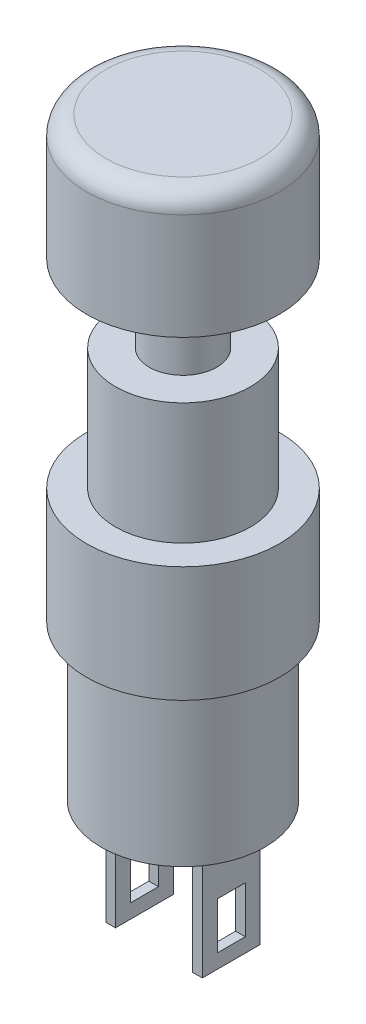
ISO-10303-21;
HEADER;
FILE_DESCRIPTION(('STEP AP214'),'2;1');
FILE_NAME('part.step','',(''),(''),'','','');
FILE_SCHEMA(('AUTOMOTIVE_DESIGN { 1 0 10303 214 1 1 1 1 }'));
ENDSEC;
DATA;
#1=APPLICATION_CONTEXT('core data for automotive mechanical design processes');
#2=APPLICATION_PROTOCOL_DEFINITION('international standard','automotive_design',2000,#1);
#3=PRODUCT_CONTEXT('',#1,'mechanical');
#4=PRODUCT('Part','Part','',(#3));
#5=PRODUCT_RELATED_PRODUCT_CATEGORY('part','',(#4));
#6=PRODUCT_DEFINITION_FORMATION('','',#4);
#7=PRODUCT_DEFINITION_CONTEXT('part definition',#1,'design');
#8=PRODUCT_DEFINITION('design','',#6,#7);
#9=PRODUCT_DEFINITION_SHAPE('','',#8);
#10=(LENGTH_UNIT() NAMED_UNIT(*) SI_UNIT(.MILLI.,.METRE.));
#11=(NAMED_UNIT(*) PLANE_ANGLE_UNIT() SI_UNIT($,.RADIAN.));
#12=(NAMED_UNIT(*) SI_UNIT($,.STERADIAN.) SOLID_ANGLE_UNIT());
#13=UNCERTAINTY_MEASURE_WITH_UNIT(LENGTH_MEASURE(1.E-05),#10,'distance_accuracy_value','');
#14=(GEOMETRIC_REPRESENTATION_CONTEXT(3) GLOBAL_UNCERTAINTY_ASSIGNED_CONTEXT((#13)) GLOBAL_UNIT_ASSIGNED_CONTEXT((#10,
#11,#12)) REPRESENTATION_CONTEXT('',''));
#15=CARTESIAN_POINT('',(0.,0.,0.));
#16=DIRECTION('',(0.,0.,1.));
#17=DIRECTION('',(1.,0.,0.));
#18=AXIS2_PLACEMENT_3D('',#15,#16,#17);
#19=CARTESIAN_POINT('',(0.,12.3,0.));
#20=DIRECTION('',(0.,1.,0.));
#21=DIRECTION('',(0.,0.,1.));
#22=AXIS2_PLACEMENT_3D('',#19,#20,#21);
#23=PLANE('',#22);
#24=CARTESIAN_POINT('',(0.,12.3,0.));
#25=DIRECTION('',(0.,1.,0.));
#26=DIRECTION('',(0.,0.,1.));
#27=AXIS2_PLACEMENT_3D('',#24,#25,#26);
#28=CIRCLE('',#27,3.5);
#29=CARTESIAN_POINT('',(0.,12.3,3.5));
#30=VERTEX_POINT('',#29);
#31=EDGE_CURVE('E399',#30,#30,#28,.T.);
#32=ORIENTED_EDGE('',*,*,#31,.T.);
#33=EDGE_LOOP('',(#32));
#34=FACE_BOUND('',#33,.T.);
#35=CARTESIAN_POINT('',(0.,12.3,0.));
#36=DIRECTION('',(0.,1.,0.));
#37=DIRECTION('',(0.,0.,1.));
#38=AXIS2_PLACEMENT_3D('',#35,#36,#37);
#39=CIRCLE('',#38,1.75);
#40=CARTESIAN_POINT('',(0.,12.3,1.75));
#41=VERTEX_POINT('',#40);
#42=EDGE_CURVE('E404',#41,#41,#39,.T.);
#43=ORIENTED_EDGE('',*,*,#42,.F.);
#44=EDGE_LOOP('',(#43));
#45=FACE_BOUND('',#44,.T.);
#46=ADVANCED_FACE('F34',(#34,#45),#23,.T.);
#47=CARTESIAN_POINT('',(0.,6.,0.));
#48=DIRECTION('',(0.,1.,0.));
#49=DIRECTION('',(0.,0.,1.));
#50=AXIS2_PLACEMENT_3D('',#47,#48,#49);
#51=PLANE('',#50);
#52=CARTESIAN_POINT('',(0.,6.,0.));
#53=DIRECTION('',(0.,1.,0.));
#54=DIRECTION('',(0.,0.,1.));
#55=AXIS2_PLACEMENT_3D('',#52,#53,#54);
#56=CIRCLE('',#55,5.);
#57=CARTESIAN_POINT('',(0.,6.,5.));
#58=VERTEX_POINT('',#57);
#59=EDGE_CURVE('E278',#58,#58,#56,.T.);
#60=ORIENTED_EDGE('',*,*,#59,.T.);
#61=EDGE_LOOP('',(#60));
#62=FACE_BOUND('',#61,.T.);
#63=CARTESIAN_POINT('',(0.,6.,0.));
#64=DIRECTION('',(0.,1.,0.));
#65=DIRECTION('',(0.,0.,1.));
#66=AXIS2_PLACEMENT_3D('',#63,#64,#65);
#67=CIRCLE('',#66,3.5);
#68=CARTESIAN_POINT('',(0.,6.,3.5));
#69=VERTEX_POINT('',#68);
#70=EDGE_CURVE('E397',#69,#69,#67,.T.);
#71=ORIENTED_EDGE('',*,*,#70,.F.);
#72=EDGE_LOOP('',(#71));
#73=FACE_BOUND('',#72,.T.);
#74=ADVANCED_FACE('F299',(#62,#73),#51,.T.);
#75=CARTESIAN_POINT('',(0.,-8.,0.));
#76=DIRECTION('',(0.,-1.,0.));
#77=DIRECTION('',(0.,0.,-1.));
#78=AXIS2_PLACEMENT_3D('',#75,#76,#77);
#79=PLANE('',#78);
#80=DIRECTION('',(-1.,0.,0.));
#81=VECTOR('',#80,1.);
#82=CARTESIAN_POINT('',(2.,-8.,1.5));
#83=LINE('',#82,#81);
#84=CARTESIAN_POINT('',(2.5,-8.,1.5));
#85=VERTEX_POINT('',#84);
#86=CARTESIAN_POINT('',(2.,-8.,1.5));
#87=VERTEX_POINT('',#86);
#88=EDGE_CURVE('E259',#85,#87,#83,.T.);
#89=ORIENTED_EDGE('',*,*,#88,.F.);
#90=DIRECTION('',(0.,0.,1.));
#91=VECTOR('',#90,1.);
#92=CARTESIAN_POINT('',(2.5,-8.,-1.5));
#93=LINE('',#92,#91);
#94=CARTESIAN_POINT('',(2.5,-8.,-1.5));
#95=VERTEX_POINT('',#94);
#96=EDGE_CURVE('E245',#95,#85,#93,.T.);
#97=ORIENTED_EDGE('',*,*,#96,.F.);
#98=DIRECTION('',(1.,0.,0.));
#99=VECTOR('',#98,1.);
#100=CARTESIAN_POINT('',(2.,-8.,-1.5));
#101=LINE('',#100,#99);
#102=CARTESIAN_POINT('',(2.,-8.,-1.5));
#103=VERTEX_POINT('',#102);
#104=EDGE_CURVE('E250',#103,#95,#101,.T.);
#105=ORIENTED_EDGE('',*,*,#104,.F.);
#106=DIRECTION('',(0.,0.,-1.));
#107=VECTOR('',#106,1.);
#108=CARTESIAN_POINT('',(2.,-8.,-1.5));
#109=LINE('',#108,#107);
#110=EDGE_CURVE('E261',#87,#103,#109,.T.);
#111=ORIENTED_EDGE('',*,*,#110,.F.);
#112=EDGE_LOOP('',(#89,#97,#105,#111));
#113=FACE_BOUND('',#112,.T.);
#114=CARTESIAN_POINT('',(0.,-8.,0.));
#115=DIRECTION('',(0.,-1.,0.));
#116=DIRECTION('',(0.,0.,-1.));
#117=AXIS2_PLACEMENT_3D('',#114,#115,#116);
#118=CIRCLE('',#117,4.25);
#119=CARTESIAN_POINT('',(0.,-8.,-4.25));
#120=VERTEX_POINT('',#119);
#121=EDGE_CURVE('E274',#120,#120,#118,.T.);
#122=ORIENTED_EDGE('',*,*,#121,.T.);
#123=EDGE_LOOP('',(#122));
#124=FACE_BOUND('',#123,.T.);
#125=DIRECTION('',(-1.,0.,0.));
#126=VECTOR('',#125,1.);
#127=CARTESIAN_POINT('',(-2.,-8.,1.5));
#128=LINE('',#127,#126);
#129=CARTESIAN_POINT('',(-2.,-8.,1.5));
#130=VERTEX_POINT('',#129);
#131=CARTESIAN_POINT('',(-2.5,-8.,1.5));
#132=VERTEX_POINT('',#131);
#133=EDGE_CURVE('E230',#130,#132,#128,.T.);
#134=ORIENTED_EDGE('',*,*,#133,.F.);
#135=DIRECTION('',(0.,0.,1.));
#136=VECTOR('',#135,1.);
#137=CARTESIAN_POINT('',(-2.,-8.,-1.5));
#138=LINE('',#137,#136);
#139=CARTESIAN_POINT('',(-2.,-8.,-1.5));
#140=VERTEX_POINT('',#139);
#141=EDGE_CURVE('E216',#140,#130,#138,.T.);
#142=ORIENTED_EDGE('',*,*,#141,.F.);
#143=DIRECTION('',(1.,0.,0.));
#144=VECTOR('',#143,1.);
#145=CARTESIAN_POINT('',(-2.,-8.,-1.5));
#146=LINE('',#145,#144);
#147=CARTESIAN_POINT('',(-2.5,-8.,-1.5));
#148=VERTEX_POINT('',#147);
#149=EDGE_CURVE('E221',#148,#140,#146,.T.);
#150=ORIENTED_EDGE('',*,*,#149,.F.);
#151=DIRECTION('',(0.,0.,-1.));
#152=VECTOR('',#151,1.);
#153=CARTESIAN_POINT('',(-2.5,-8.,-1.5));
#154=LINE('',#153,#152);
#155=EDGE_CURVE('E232',#132,#148,#154,.T.);
#156=ORIENTED_EDGE('',*,*,#155,.F.);
#157=EDGE_LOOP('',(#134,#142,#150,#156));
#158=FACE_BOUND('',#157,.T.);
#159=ADVANCED_FACE('F305',(#113,#124,#158),#79,.T.);
#160=CARTESIAN_POINT('',(0.,0.,0.));
#161=DIRECTION('',(0.,1.,0.));
#162=DIRECTION('',(0.,0.,1.));
#163=AXIS2_PLACEMENT_3D('',#160,#161,#162);
#164=PLANE('',#163);
#165=CARTESIAN_POINT('',(0.,0.,0.));
#166=DIRECTION('',(0.,1.,0.));
#167=DIRECTION('',(0.,0.,1.));
#168=AXIS2_PLACEMENT_3D('',#165,#166,#167);
#169=CIRCLE('',#168,5.);
#170=CARTESIAN_POINT('',(0.,0.,5.));
#171=VERTEX_POINT('',#170);
#172=EDGE_CURVE('E277',#171,#171,#169,.T.);
#173=ORIENTED_EDGE('',*,*,#172,.F.);
#174=EDGE_LOOP('',(#173));
#175=FACE_BOUND('',#174,.T.);
#176=CARTESIAN_POINT('',(0.,0.,0.));
#177=DIRECTION('',(0.,1.,0.));
#178=DIRECTION('',(0.,0.,1.));
#179=AXIS2_PLACEMENT_3D('',#176,#177,#178);
#180=CIRCLE('',#179,4.25);
#181=CARTESIAN_POINT('',(0.,0.,4.25));
#182=VERTEX_POINT('',#181);
#183=EDGE_CURVE('E281',#182,#182,#180,.F.);
#184=ORIENTED_EDGE('',*,*,#183,.F.);
#185=EDGE_LOOP('',(#184));
#186=FACE_BOUND('',#185,.T.);
#187=ADVANCED_FACE('F376',(#175,#186),#164,.F.);
#188=CARTESIAN_POINT('',(0.,6.,0.));
#189=DIRECTION('',(0.,-1.,0.));
#190=DIRECTION('',(0.,0.,-1.));
#191=AXIS2_PLACEMENT_3D('',#188,#189,#190);
#192=CYLINDRICAL_SURFACE('',#191,5.);
#193=ORIENTED_EDGE('',*,*,#59,.F.);
#194=EDGE_LOOP('',(#193));
#195=FACE_BOUND('',#194,.T.);
#196=ORIENTED_EDGE('',*,*,#172,.T.);
#197=EDGE_LOOP('',(#196));
#198=FACE_BOUND('',#197,.T.);
#199=ADVANCED_FACE('F379',(#195,#198),#192,.T.);
#200=CARTESIAN_POINT('',(0.,-8.,0.));
#201=DIRECTION('',(0.,1.,0.));
#202=DIRECTION('',(0.,0.,1.));
#203=AXIS2_PLACEMENT_3D('',#200,#201,#202);
#204=CYLINDRICAL_SURFACE('',#203,4.25);
#205=ORIENTED_EDGE('',*,*,#121,.F.);
#206=EDGE_LOOP('',(#205));
#207=FACE_BOUND('',#206,.T.);
#208=ORIENTED_EDGE('',*,*,#183,.T.);
#209=EDGE_LOOP('',(#208));
#210=FACE_BOUND('',#209,.T.);
#211=ADVANCED_FACE('F372',(#207,#210),#204,.T.);
#212=CARTESIAN_POINT('',(2.5,-14.,-1.5));
#213=DIRECTION('',(-1.,0.,0.));
#214=DIRECTION('',(0.,0.,1.));
#215=AXIS2_PLACEMENT_3D('',#212,#213,#214);
#216=PLANE('',#215);
#217=DIRECTION('',(0.,0.,-1.));
#218=VECTOR('',#217,1.);
#219=CARTESIAN_POINT('',(2.5,-10.8387417934711,-1.5));
#220=LINE('',#219,#218);
#221=CARTESIAN_POINT('',(2.5,-10.8387417934711,0.71438599194853));
#222=VERTEX_POINT('',#221);
#223=CARTESIAN_POINT('',(2.5,-10.8387417934711,-0.728581274216814));
#224=VERTEX_POINT('',#223);
#225=EDGE_CURVE('E204',#222,#224,#220,.T.);
#226=ORIENTED_EDGE('',*,*,#225,.T.);
#227=DIRECTION('',(0.,-1.,0.));
#228=VECTOR('',#227,1.);
#229=CARTESIAN_POINT('',(2.5,-14.,-0.728581274216814));
#230=LINE('',#229,#228);
#231=CARTESIAN_POINT('',(2.5,-13.2621868174154,-0.728581274216814));
#232=VERTEX_POINT('',#231);
#233=EDGE_CURVE('E213',#224,#232,#230,.T.);
#234=ORIENTED_EDGE('',*,*,#233,.T.);
#235=DIRECTION('',(0.,0.,1.));
#236=VECTOR('',#235,1.);
#237=CARTESIAN_POINT('',(2.5,-13.2621868174154,-1.5));
#238=LINE('',#237,#236);
#239=CARTESIAN_POINT('',(2.5,-13.2621868174154,0.714385991948531));
#240=VERTEX_POINT('',#239);
#241=EDGE_CURVE('E188',#232,#240,#238,.T.);
#242=ORIENTED_EDGE('',*,*,#241,.T.);
#243=DIRECTION('',(0.,1.,0.));
#244=VECTOR('',#243,1.);
#245=CARTESIAN_POINT('',(2.5,-14.,0.71438599194853));
#246=LINE('',#245,#244);
#247=EDGE_CURVE('E195',#240,#222,#246,.T.);
#248=ORIENTED_EDGE('',*,*,#247,.T.);
#249=EDGE_LOOP('',(#226,#234,#242,#248));
#250=FACE_BOUND('',#249,.T.);
#251=ORIENTED_EDGE('',*,*,#96,.T.);
#252=DIRECTION('',(0.,1.,0.));
#253=VECTOR('',#252,1.);
#254=CARTESIAN_POINT('',(2.5,-14.,1.5));
#255=LINE('',#254,#253);
#256=CARTESIAN_POINT('',(2.5,-14.,1.5));
#257=VERTEX_POINT('',#256);
#258=EDGE_CURVE('E272',#257,#85,#255,.T.);
#259=ORIENTED_EDGE('',*,*,#258,.F.);
#260=DIRECTION('',(0.,0.,1.));
#261=VECTOR('',#260,1.);
#262=CARTESIAN_POINT('',(2.5,-14.,-1.5));
#263=LINE('',#262,#261);
#264=CARTESIAN_POINT('',(2.5,-14.,-1.5));
#265=VERTEX_POINT('',#264);
#266=EDGE_CURVE('E246',#265,#257,#263,.T.);
#267=ORIENTED_EDGE('',*,*,#266,.F.);
#268=DIRECTION('',(0.,1.,0.));
#269=VECTOR('',#268,1.);
#270=CARTESIAN_POINT('',(2.5,-14.,-1.5));
#271=LINE('',#270,#269);
#272=EDGE_CURVE('E256',#265,#95,#271,.T.);
#273=ORIENTED_EDGE('',*,*,#272,.T.);
#274=EDGE_LOOP('',(#251,#259,#267,#273));
#275=FACE_BOUND('',#274,.T.);
#276=ADVANCED_FACE('F368',(#250,#275),#216,.F.);
#277=CARTESIAN_POINT('',(2.,-14.,1.5));
#278=DIRECTION('',(0.,0.,-1.));
#279=DIRECTION('',(-1.,0.,0.));
#280=AXIS2_PLACEMENT_3D('',#277,#278,#279);
#281=PLANE('',#280);
#282=ORIENTED_EDGE('',*,*,#88,.T.);
#283=DIRECTION('',(0.,1.,0.));
#284=VECTOR('',#283,1.);
#285=CARTESIAN_POINT('',(2.,-14.,1.5));
#286=LINE('',#285,#284);
#287=CARTESIAN_POINT('',(2.,-14.,1.5));
#288=VERTEX_POINT('',#287);
#289=EDGE_CURVE('E269',#288,#87,#286,.T.);
#290=ORIENTED_EDGE('',*,*,#289,.F.);
#291=DIRECTION('',(-1.,0.,0.));
#292=VECTOR('',#291,1.);
#293=CARTESIAN_POINT('',(2.,-14.,1.5));
#294=LINE('',#293,#292);
#295=EDGE_CURVE('E249',#257,#288,#294,.T.);
#296=ORIENTED_EDGE('',*,*,#295,.F.);
#297=ORIENTED_EDGE('',*,*,#258,.T.);
#298=EDGE_LOOP('',(#282,#290,#296,#297));
#299=FACE_BOUND('',#298,.T.);
#300=ADVANCED_FACE('F364',(#299),#281,.F.);
#301=CARTESIAN_POINT('',(2.,-14.,-1.5));
#302=DIRECTION('',(1.,0.,0.));
#303=DIRECTION('',(0.,0.,-1.));
#304=AXIS2_PLACEMENT_3D('',#301,#302,#303);
#305=PLANE('',#304);
#306=DIRECTION('',(0.,0.,-1.));
#307=VECTOR('',#306,1.);
#308=CARTESIAN_POINT('',(2.,-13.2621868174154,-1.5));
#309=LINE('',#308,#307);
#310=CARTESIAN_POINT('',(2.,-13.2621868174154,0.71438599194853));
#311=VERTEX_POINT('',#310);
#312=CARTESIAN_POINT('',(2.,-13.2621868174154,-0.728581274216815));
#313=VERTEX_POINT('',#312);
#314=EDGE_CURVE('E185',#311,#313,#309,.T.);
#315=ORIENTED_EDGE('',*,*,#314,.T.);
#316=DIRECTION('',(0.,1.,0.));
#317=VECTOR('',#316,1.);
#318=CARTESIAN_POINT('',(2.,-14.,-0.728581274216814));
#319=LINE('',#318,#317);
#320=CARTESIAN_POINT('',(2.,-10.8387417934711,-0.728581274216814));
#321=VERTEX_POINT('',#320);
#322=EDGE_CURVE('E210',#313,#321,#319,.T.);
#323=ORIENTED_EDGE('',*,*,#322,.T.);
#324=DIRECTION('',(0.,0.,1.));
#325=VECTOR('',#324,1.);
#326=CARTESIAN_POINT('',(2.,-10.8387417934711,-1.5));
#327=LINE('',#326,#325);
#328=CARTESIAN_POINT('',(2.,-10.8387417934711,0.71438599194853));
#329=VERTEX_POINT('',#328);
#330=EDGE_CURVE('E201',#321,#329,#327,.T.);
#331=ORIENTED_EDGE('',*,*,#330,.T.);
#332=DIRECTION('',(0.,-1.,0.));
#333=VECTOR('',#332,1.);
#334=CARTESIAN_POINT('',(2.,-14.,0.71438599194853));
#335=LINE('',#334,#333);
#336=EDGE_CURVE('E192',#329,#311,#335,.T.);
#337=ORIENTED_EDGE('',*,*,#336,.T.);
#338=EDGE_LOOP('',(#315,#323,#331,#337));
#339=FACE_BOUND('',#338,.T.);
#340=ORIENTED_EDGE('',*,*,#110,.T.);
#341=DIRECTION('',(0.,1.,0.));
#342=VECTOR('',#341,1.);
#343=CARTESIAN_POINT('',(2.,-14.,-1.5));
#344=LINE('',#343,#342);
#345=CARTESIAN_POINT('',(2.,-14.,-1.5));
#346=VERTEX_POINT('',#345);
#347=EDGE_CURVE('E267',#346,#103,#344,.T.);
#348=ORIENTED_EDGE('',*,*,#347,.F.);
#349=DIRECTION('',(0.,0.,-1.));
#350=VECTOR('',#349,1.);
#351=CARTESIAN_POINT('',(2.,-14.,-1.5));
#352=LINE('',#351,#350);
#353=EDGE_CURVE('E252',#288,#346,#352,.T.);
#354=ORIENTED_EDGE('',*,*,#353,.F.);
#355=ORIENTED_EDGE('',*,*,#289,.T.);
#356=EDGE_LOOP('',(#340,#348,#354,#355));
#357=FACE_BOUND('',#356,.T.);
#358=ADVANCED_FACE('F360',(#339,#357),#305,.F.);
#359=CARTESIAN_POINT('',(2.,-14.,-1.5));
#360=DIRECTION('',(0.,0.,1.));
#361=DIRECTION('',(1.,0.,0.));
#362=AXIS2_PLACEMENT_3D('',#359,#360,#361);
#363=PLANE('',#362);
#364=ORIENTED_EDGE('',*,*,#104,.T.);
#365=ORIENTED_EDGE('',*,*,#272,.F.);
#366=DIRECTION('',(1.,0.,0.));
#367=VECTOR('',#366,1.);
#368=CARTESIAN_POINT('',(2.,-14.,-1.5));
#369=LINE('',#368,#367);
#370=EDGE_CURVE('E254',#346,#265,#369,.T.);
#371=ORIENTED_EDGE('',*,*,#370,.F.);
#372=ORIENTED_EDGE('',*,*,#347,.T.);
#373=EDGE_LOOP('',(#364,#365,#371,#372));
#374=FACE_BOUND('',#373,.T.);
#375=ADVANCED_FACE('F356',(#374),#363,.F.);
#376=CARTESIAN_POINT('',(2.5,-14.,1.5));
#377=DIRECTION('',(0.,1.,0.));
#378=DIRECTION('',(0.,0.,1.));
#379=AXIS2_PLACEMENT_3D('',#376,#377,#378);
#380=PLANE('',#379);
#381=ORIENTED_EDGE('',*,*,#266,.T.);
#382=ORIENTED_EDGE('',*,*,#295,.T.);
#383=ORIENTED_EDGE('',*,*,#353,.T.);
#384=ORIENTED_EDGE('',*,*,#370,.T.);
#385=EDGE_LOOP('',(#381,#382,#383,#384));
#386=FACE_BOUND('',#385,.T.);
#387=ADVANCED_FACE('F352',(#386),#380,.F.);
#388=CARTESIAN_POINT('',(-2.,-14.,-1.5));
#389=DIRECTION('',(-1.,0.,0.));
#390=DIRECTION('',(0.,0.,1.));
#391=AXIS2_PLACEMENT_3D('',#388,#389,#390);
#392=PLANE('',#391);
#393=DIRECTION('',(0.,0.,-1.));
#394=VECTOR('',#393,1.);
#395=CARTESIAN_POINT('',(-2.,-10.8387417934711,-1.5));
#396=LINE('',#395,#394);
#397=CARTESIAN_POINT('',(-2.,-10.8387417934711,0.714385991948529));
#398=VERTEX_POINT('',#397);
#399=CARTESIAN_POINT('',(-2.,-10.8387417934711,-0.728581274216815));
#400=VERTEX_POINT('',#399);
#401=EDGE_CURVE('E198',#398,#400,#396,.T.);
#402=ORIENTED_EDGE('',*,*,#401,.T.);
#403=DIRECTION('',(0.,-1.,0.));
#404=VECTOR('',#403,1.);
#405=CARTESIAN_POINT('',(-2.,-14.,-0.728581274216815));
#406=LINE('',#405,#404);
#407=CARTESIAN_POINT('',(-2.,-13.2621868174154,-0.728581274216815));
#408=VERTEX_POINT('',#407);
#409=EDGE_CURVE('E207',#400,#408,#406,.T.);
#410=ORIENTED_EDGE('',*,*,#409,.T.);
#411=DIRECTION('',(0.,0.,1.));
#412=VECTOR('',#411,1.);
#413=CARTESIAN_POINT('',(-2.,-13.2621868174154,-1.5));
#414=LINE('',#413,#412);
#415=CARTESIAN_POINT('',(-2.,-13.2621868174154,0.714385991948531));
#416=VERTEX_POINT('',#415);
#417=EDGE_CURVE('E183',#408,#416,#414,.T.);
#418=ORIENTED_EDGE('',*,*,#417,.T.);
#419=DIRECTION('',(0.,1.,0.));
#420=VECTOR('',#419,1.);
#421=CARTESIAN_POINT('',(-2.,-14.,0.714385991948529));
#422=LINE('',#421,#420);
#423=EDGE_CURVE('E154',#416,#398,#422,.T.);
#424=ORIENTED_EDGE('',*,*,#423,.T.);
#425=EDGE_LOOP('',(#402,#410,#418,#424));
#426=FACE_BOUND('',#425,.T.);
#427=ORIENTED_EDGE('',*,*,#141,.T.);
#428=DIRECTION('',(0.,1.,0.));
#429=VECTOR('',#428,1.);
#430=CARTESIAN_POINT('',(-2.,-14.,1.5));
#431=LINE('',#430,#429);
#432=CARTESIAN_POINT('',(-2.,-14.,1.5));
#433=VERTEX_POINT('',#432);
#434=EDGE_CURVE('E243',#433,#130,#431,.T.);
#435=ORIENTED_EDGE('',*,*,#434,.F.);
#436=DIRECTION('',(0.,0.,1.));
#437=VECTOR('',#436,1.);
#438=CARTESIAN_POINT('',(-2.,-14.,-1.5));
#439=LINE('',#438,#437);
#440=CARTESIAN_POINT('',(-2.,-14.,-1.5));
#441=VERTEX_POINT('',#440);
#442=EDGE_CURVE('E217',#441,#433,#439,.T.);
#443=ORIENTED_EDGE('',*,*,#442,.F.);
#444=DIRECTION('',(0.,1.,0.));
#445=VECTOR('',#444,1.);
#446=CARTESIAN_POINT('',(-2.,-14.,-1.5));
#447=LINE('',#446,#445);
#448=EDGE_CURVE('E227',#441,#140,#447,.T.);
#449=ORIENTED_EDGE('',*,*,#448,.T.);
#450=EDGE_LOOP('',(#427,#435,#443,#449));
#451=FACE_BOUND('',#450,.T.);
#452=ADVANCED_FACE('F348',(#426,#451),#392,.F.);
#453=CARTESIAN_POINT('',(-2.,-14.,1.5));
#454=DIRECTION('',(0.,0.,-1.));
#455=DIRECTION('',(-1.,0.,0.));
#456=AXIS2_PLACEMENT_3D('',#453,#454,#455);
#457=PLANE('',#456);
#458=ORIENTED_EDGE('',*,*,#133,.T.);
#459=DIRECTION('',(0.,1.,0.));
#460=VECTOR('',#459,1.);
#461=CARTESIAN_POINT('',(-2.5,-14.,1.5));
#462=LINE('',#461,#460);
#463=CARTESIAN_POINT('',(-2.5,-14.,1.5));
#464=VERTEX_POINT('',#463);
#465=EDGE_CURVE('E240',#464,#132,#462,.T.);
#466=ORIENTED_EDGE('',*,*,#465,.F.);
#467=DIRECTION('',(-1.,0.,0.));
#468=VECTOR('',#467,1.);
#469=CARTESIAN_POINT('',(-2.,-14.,1.5));
#470=LINE('',#469,#468);
#471=EDGE_CURVE('E220',#433,#464,#470,.T.);
#472=ORIENTED_EDGE('',*,*,#471,.F.);
#473=ORIENTED_EDGE('',*,*,#434,.T.);
#474=EDGE_LOOP('',(#458,#466,#472,#473));
#475=FACE_BOUND('',#474,.T.);
#476=ADVANCED_FACE('F345',(#475),#457,.F.);
#477=CARTESIAN_POINT('',(-2.5,-14.,-1.5));
#478=DIRECTION('',(1.,0.,0.));
#479=DIRECTION('',(0.,0.,-1.));
#480=AXIS2_PLACEMENT_3D('',#477,#478,#479);
#481=PLANE('',#480);
#482=DIRECTION('',(0.,0.,1.));
#483=VECTOR('',#482,1.);
#484=CARTESIAN_POINT('',(-2.5,-13.2621868174154,-0.728581274216815));
#485=LINE('',#484,#483);
#486=CARTESIAN_POINT('',(-2.5,-13.2621868174154,-0.728581274216815));
#487=VERTEX_POINT('',#486);
#488=CARTESIAN_POINT('',(-2.5,-13.2621868174154,0.714385991948529));
#489=VERTEX_POINT('',#488);
#490=EDGE_CURVE('E160',#487,#489,#485,.T.);
#491=ORIENTED_EDGE('',*,*,#490,.F.);
#492=DIRECTION('',(0.,-1.,0.));
#493=VECTOR('',#492,1.);
#494=CARTESIAN_POINT('',(-2.5,-13.2621868174154,-0.728581274216815));
#495=LINE('',#494,#493);
#496=CARTESIAN_POINT('',(-2.5,-10.8387417934711,-0.728581274216815));
#497=VERTEX_POINT('',#496);
#498=EDGE_CURVE('E166',#497,#487,#495,.T.);
#499=ORIENTED_EDGE('',*,*,#498,.F.);
#500=DIRECTION('',(0.,0.,-1.));
#501=VECTOR('',#500,1.);
#502=CARTESIAN_POINT('',(-2.5,-10.8387417934711,-0.728581274216815));
#503=LINE('',#502,#501);
#504=CARTESIAN_POINT('',(-2.5,-10.8387417934711,0.714385991948529));
#505=VERTEX_POINT('',#504);
#506=EDGE_CURVE('E171',#505,#497,#503,.T.);
#507=ORIENTED_EDGE('',*,*,#506,.F.);
#508=DIRECTION('',(0.,1.,0.));
#509=VECTOR('',#508,1.);
#510=CARTESIAN_POINT('',(-2.5,-13.2621868174154,0.714385991948529));
#511=LINE('',#510,#509);
#512=EDGE_CURVE('E151',#489,#505,#511,.T.);
#513=ORIENTED_EDGE('',*,*,#512,.F.);
#514=EDGE_LOOP('',(#491,#499,#507,#513));
#515=FACE_BOUND('',#514,.T.);
#516=ORIENTED_EDGE('',*,*,#155,.T.);
#517=DIRECTION('',(0.,1.,0.));
#518=VECTOR('',#517,1.);
#519=CARTESIAN_POINT('',(-2.5,-14.,-1.5));
#520=LINE('',#519,#518);
#521=CARTESIAN_POINT('',(-2.5,-14.,-1.5));
#522=VERTEX_POINT('',#521);
#523=EDGE_CURVE('E238',#522,#148,#520,.T.);
#524=ORIENTED_EDGE('',*,*,#523,.F.);
#525=DIRECTION('',(0.,0.,-1.));
#526=VECTOR('',#525,1.);
#527=CARTESIAN_POINT('',(-2.5,-14.,-1.5));
#528=LINE('',#527,#526);
#529=EDGE_CURVE('E223',#464,#522,#528,.T.);
#530=ORIENTED_EDGE('',*,*,#529,.F.);
#531=ORIENTED_EDGE('',*,*,#465,.T.);
#532=EDGE_LOOP('',(#516,#524,#530,#531));
#533=FACE_BOUND('',#532,.T.);
#534=ADVANCED_FACE('F168',(#515,#533),#481,.F.);
#535=CARTESIAN_POINT('',(-2.,-14.,-1.5));
#536=DIRECTION('',(0.,0.,1.));
#537=DIRECTION('',(1.,0.,0.));
#538=AXIS2_PLACEMENT_3D('',#535,#536,#537);
#539=PLANE('',#538);
#540=ORIENTED_EDGE('',*,*,#149,.T.);
#541=ORIENTED_EDGE('',*,*,#448,.F.);
#542=DIRECTION('',(1.,0.,0.));
#543=VECTOR('',#542,1.);
#544=CARTESIAN_POINT('',(-2.,-14.,-1.5));
#545=LINE('',#544,#543);
#546=EDGE_CURVE('E225',#522,#441,#545,.T.);
#547=ORIENTED_EDGE('',*,*,#546,.F.);
#548=ORIENTED_EDGE('',*,*,#523,.T.);
#549=EDGE_LOOP('',(#540,#541,#547,#548));
#550=FACE_BOUND('',#549,.T.);
#551=ADVANCED_FACE('F338',(#550),#539,.F.);
#552=CARTESIAN_POINT('',(-2.,-14.,1.5));
#553=DIRECTION('',(0.,-1.,0.));
#554=DIRECTION('',(0.,0.,-1.));
#555=AXIS2_PLACEMENT_3D('',#552,#553,#554);
#556=PLANE('',#555);
#557=ORIENTED_EDGE('',*,*,#442,.T.);
#558=ORIENTED_EDGE('',*,*,#471,.T.);
#559=ORIENTED_EDGE('',*,*,#529,.T.);
#560=ORIENTED_EDGE('',*,*,#546,.T.);
#561=EDGE_LOOP('',(#557,#558,#559,#560));
#562=FACE_BOUND('',#561,.T.);
#563=ADVANCED_FACE('F335',(#562),#556,.T.);
#564=CARTESIAN_POINT('',(5.,-13.2621868174154,-0.728581274216813));
#565=DIRECTION('',(0.,-1.,0.));
#566=DIRECTION('',(0.,0.,-1.));
#567=AXIS2_PLACEMENT_3D('',#564,#565,#566);
#568=PLANE('',#567);
#569=DIRECTION('',(-1.,0.,0.));
#570=VECTOR('',#569,1.);
#571=CARTESIAN_POINT('',(5.,-13.2621868174154,-0.728581274216813));
#572=LINE('',#571,#570);
#573=EDGE_CURVE('E163',#408,#487,#572,.T.);
#574=ORIENTED_EDGE('',*,*,#573,.T.);
#575=ORIENTED_EDGE('',*,*,#490,.T.);
#576=DIRECTION('',(-1.,0.,0.));
#577=VECTOR('',#576,1.);
#578=CARTESIAN_POINT('',(5.,-13.2621868174154,0.714385991948531));
#579=LINE('',#578,#577);
#580=EDGE_CURVE('E146',#416,#489,#579,.T.);
#581=ORIENTED_EDGE('',*,*,#580,.F.);
#582=ORIENTED_EDGE('',*,*,#417,.F.);
#583=EDGE_LOOP('',(#574,#575,#581,#582));
#584=FACE_BOUND('',#583,.T.);
#585=ADVANCED_FACE('F161',(#584),#568,.F.);
#586=CARTESIAN_POINT('',(5.,-13.2621868174154,0.714385991948531));
#587=DIRECTION('',(0.,0.,1.));
#588=DIRECTION('',(1.,0.,0.));
#589=AXIS2_PLACEMENT_3D('',#586,#587,#588);
#590=PLANE('',#589);
#591=ORIENTED_EDGE('',*,*,#580,.T.);
#592=ORIENTED_EDGE('',*,*,#512,.T.);
#593=DIRECTION('',(-1.,0.,0.));
#594=VECTOR('',#593,1.);
#595=CARTESIAN_POINT('',(5.,-10.8387417934711,0.714385991948531));
#596=LINE('',#595,#594);
#597=EDGE_CURVE('E180',#398,#505,#596,.T.);
#598=ORIENTED_EDGE('',*,*,#597,.F.);
#599=ORIENTED_EDGE('',*,*,#423,.F.);
#600=EDGE_LOOP('',(#591,#592,#598,#599));
#601=FACE_BOUND('',#600,.T.);
#602=ADVANCED_FACE('F148',(#601),#590,.F.);
#603=CARTESIAN_POINT('',(5.,-10.8387417934711,-0.728581274216813));
#604=DIRECTION('',(0.,1.,0.));
#605=DIRECTION('',(0.,0.,1.));
#606=AXIS2_PLACEMENT_3D('',#603,#604,#605);
#607=PLANE('',#606);
#608=ORIENTED_EDGE('',*,*,#597,.T.);
#609=ORIENTED_EDGE('',*,*,#506,.T.);
#610=DIRECTION('',(-1.,0.,0.));
#611=VECTOR('',#610,1.);
#612=CARTESIAN_POINT('',(5.,-10.8387417934711,-0.728581274216813));
#613=LINE('',#612,#611);
#614=EDGE_CURVE('E176',#400,#497,#613,.T.);
#615=ORIENTED_EDGE('',*,*,#614,.F.);
#616=ORIENTED_EDGE('',*,*,#401,.F.);
#617=EDGE_LOOP('',(#608,#609,#615,#616));
#618=FACE_BOUND('',#617,.T.);
#619=ADVANCED_FACE('F325',(#618),#607,.F.);
#620=CARTESIAN_POINT('',(5.,-13.2621868174154,-0.728581274216813));
#621=DIRECTION('',(0.,0.,-1.));
#622=DIRECTION('',(-1.,0.,0.));
#623=AXIS2_PLACEMENT_3D('',#620,#621,#622);
#624=PLANE('',#623);
#625=ORIENTED_EDGE('',*,*,#614,.T.);
#626=ORIENTED_EDGE('',*,*,#498,.T.);
#627=ORIENTED_EDGE('',*,*,#573,.F.);
#628=ORIENTED_EDGE('',*,*,#409,.F.);
#629=EDGE_LOOP('',(#625,#626,#627,#628));
#630=FACE_BOUND('',#629,.T.);
#631=ADVANCED_FACE('F333',(#630),#624,.F.);
#632=EDGE_CURVE('E178',#224,#321,#613,.T.);
#633=ORIENTED_EDGE('',*,*,#632,.T.);
#634=ORIENTED_EDGE('',*,*,#322,.F.);
#635=EDGE_CURVE('E54',#232,#313,#572,.T.);
#636=ORIENTED_EDGE('',*,*,#635,.F.);
#637=ORIENTED_EDGE('',*,*,#233,.F.);
#638=EDGE_LOOP('',(#633,#634,#636,#637));
#639=FACE_BOUND('',#638,.T.);
#640=ADVANCED_FACE('F323',(#639),#624,.F.);
#641=EDGE_CURVE('E179',#222,#329,#596,.T.);
#642=ORIENTED_EDGE('',*,*,#641,.T.);
#643=ORIENTED_EDGE('',*,*,#330,.F.);
#644=ORIENTED_EDGE('',*,*,#632,.F.);
#645=ORIENTED_EDGE('',*,*,#225,.F.);
#646=EDGE_LOOP('',(#642,#643,#644,#645));
#647=FACE_BOUND('',#646,.T.);
#648=ADVANCED_FACE('F319',(#647),#607,.F.);
#649=EDGE_CURVE('E49',#240,#311,#579,.T.);
#650=ORIENTED_EDGE('',*,*,#649,.T.);
#651=ORIENTED_EDGE('',*,*,#336,.F.);
#652=ORIENTED_EDGE('',*,*,#641,.F.);
#653=ORIENTED_EDGE('',*,*,#247,.F.);
#654=EDGE_LOOP('',(#650,#651,#652,#653));
#655=FACE_BOUND('',#654,.T.);
#656=ADVANCED_FACE('F322',(#655),#590,.F.);
#657=ORIENTED_EDGE('',*,*,#635,.T.);
#658=ORIENTED_EDGE('',*,*,#314,.F.);
#659=ORIENTED_EDGE('',*,*,#649,.F.);
#660=ORIENTED_EDGE('',*,*,#241,.F.);
#661=EDGE_LOOP('',(#657,#658,#659,#660));
#662=FACE_BOUND('',#661,.T.);
#663=ADVANCED_FACE('F317',(#662),#568,.F.);
#664=CARTESIAN_POINT('',(0.,12.3,0.));
#665=DIRECTION('',(0.,-1.,0.));
#666=DIRECTION('',(0.,0.,-1.));
#667=AXIS2_PLACEMENT_3D('',#664,#665,#666);
#668=CYLINDRICAL_SURFACE('',#667,3.5);
#669=ORIENTED_EDGE('',*,*,#31,.F.);
#670=EDGE_LOOP('',(#669));
#671=FACE_BOUND('',#670,.T.);
#672=ORIENTED_EDGE('',*,*,#70,.T.);
#673=EDGE_LOOP('',(#672));
#674=FACE_BOUND('',#673,.T.);
#675=ADVANCED_FACE('F314',(#671,#674),#668,.T.);
#676=CARTESIAN_POINT('',(0.,16.3,0.));
#677=DIRECTION('',(0.,-1.,0.));
#678=DIRECTION('',(0.,0.,-1.));
#679=AXIS2_PLACEMENT_3D('',#676,#677,#678);
#680=CYLINDRICAL_SURFACE('',#679,1.75);
#681=CARTESIAN_POINT('',(0.,16.3,0.));
#682=DIRECTION('',(0.,1.,0.));
#683=DIRECTION('',(0.,0.,1.));
#684=AXIS2_PLACEMENT_3D('',#681,#682,#683);
#685=CIRCLE('',#684,1.75);
#686=CARTESIAN_POINT('',(0.,16.3,1.75));
#687=VERTEX_POINT('',#686);
#688=EDGE_CURVE('E400',#687,#687,#685,.T.);
#689=ORIENTED_EDGE('',*,*,#688,.F.);
#690=EDGE_LOOP('',(#689));
#691=FACE_BOUND('',#690,.T.);
#692=ORIENTED_EDGE('',*,*,#42,.T.);
#693=EDGE_LOOP('',(#692));
#694=FACE_BOUND('',#693,.T.);
#695=ADVANCED_FACE('F312',(#691,#694),#680,.T.);
#696=CARTESIAN_POINT('',(0.,16.3,0.));
#697=DIRECTION('',(0.,1.,0.));
#698=DIRECTION('',(0.,0.,1.));
#699=AXIS2_PLACEMENT_3D('',#696,#697,#698);
#700=PLANE('',#699);
#701=CARTESIAN_POINT('',(0.,16.3,0.));
#702=DIRECTION('',(0.,1.,0.));
#703=DIRECTION('',(0.,0.,1.));
#704=AXIS2_PLACEMENT_3D('',#701,#702,#703);
#705=CIRCLE('',#704,5.);
#706=CARTESIAN_POINT('',(0.,16.3,5.));
#707=VERTEX_POINT('',#706);
#708=EDGE_CURVE('E550',#707,#707,#705,.T.);
#709=ORIENTED_EDGE('',*,*,#708,.F.);
#710=EDGE_LOOP('',(#709));
#711=FACE_BOUND('',#710,.T.);
#712=ORIENTED_EDGE('',*,*,#688,.T.);
#713=EDGE_LOOP('',(#712));
#714=FACE_BOUND('',#713,.T.);
#715=ADVANCED_FACE('F516',(#711,#714),#700,.F.);
#716=CARTESIAN_POINT('',(0.,22.8,0.));
#717=DIRECTION('',(0.,-1.,0.));
#718=DIRECTION('',(0.,0.,-1.));
#719=AXIS2_PLACEMENT_3D('',#716,#717,#718);
#720=CYLINDRICAL_SURFACE('',#719,5.);
#721=CARTESIAN_POINT('',(0.,21.8,0.));
#722=DIRECTION('',(0.,1.,0.));
#723=DIRECTION('',(0.,0.,1.));
#724=AXIS2_PLACEMENT_3D('',#721,#722,#723);
#725=CIRCLE('',#724,5.);
#726=CARTESIAN_POINT('',(0.,21.8,5.));
#727=VERTEX_POINT('',#726);
#728=EDGE_CURVE('E11',#727,#727,#725,.F.);
#729=ORIENTED_EDGE('',*,*,#728,.T.);
#730=EDGE_LOOP('',(#729));
#731=FACE_BOUND('',#730,.T.);
#732=ORIENTED_EDGE('',*,*,#708,.T.);
#733=EDGE_LOOP('',(#732));
#734=FACE_BOUND('',#733,.T.);
#735=ADVANCED_FACE('F295',(#731,#734),#720,.T.);
#736=CARTESIAN_POINT('',(0.,22.8,0.));
#737=DIRECTION('',(0.,1.,0.));
#738=DIRECTION('',(0.,0.,1.));
#739=AXIS2_PLACEMENT_3D('',#736,#737,#738);
#740=PLANE('',#739);
#741=CARTESIAN_POINT('',(0.,22.8,0.));
#742=DIRECTION('',(0.,1.,0.));
#743=DIRECTION('',(0.,0.,1.));
#744=AXIS2_PLACEMENT_3D('',#741,#742,#743);
#745=CIRCLE('',#744,4.);
#746=CARTESIAN_POINT('',(0.,22.8,4.));
#747=VERTEX_POINT('',#746);
#748=EDGE_CURVE('E42',#747,#747,#745,.T.);
#749=ORIENTED_EDGE('',*,*,#748,.T.);
#750=EDGE_LOOP('',(#749));
#751=FACE_BOUND('',#750,.T.);
#752=ADVANCED_FACE('F288',(#751),#740,.T.);
#753=CARTESIAN_POINT('',(0.,21.8,0.));
#754=DIRECTION('',(0.,1.,0.));
#755=DIRECTION('',(0.,0.,1.));
#756=AXIS2_PLACEMENT_3D('',#753,#754,#755);
#757=TOROIDAL_SURFACE('',#756,4.,1.);
#758=ORIENTED_EDGE('',*,*,#728,.F.);
#759=EDGE_LOOP('',(#758));
#760=FACE_BOUND('',#759,.T.);
#761=ORIENTED_EDGE('',*,*,#748,.F.);
#762=EDGE_LOOP('',(#761));
#763=FACE_BOUND('',#762,.T.);
#764=ADVANCED_FACE('F36',(#760,#763),#757,.T.);
#765=CLOSED_SHELL('',(#46,#74,#159,#187,#199,#211,#276,#300,#358,#375,#387,#452,#476,#534,#551,
#563,#585,#602,#619,#631,#640,#648,#656,#663,#675,#695,#715,#735,#752,#764));
#766=MANIFOLD_SOLID_BREP('B2',#765);
#767=ADVANCED_BREP_SHAPE_REPRESENTATION('',(#18,#766),#14);
#768=SHAPE_DEFINITION_REPRESENTATION(#9,#767);
ENDSEC;
END-ISO-10303-21;
